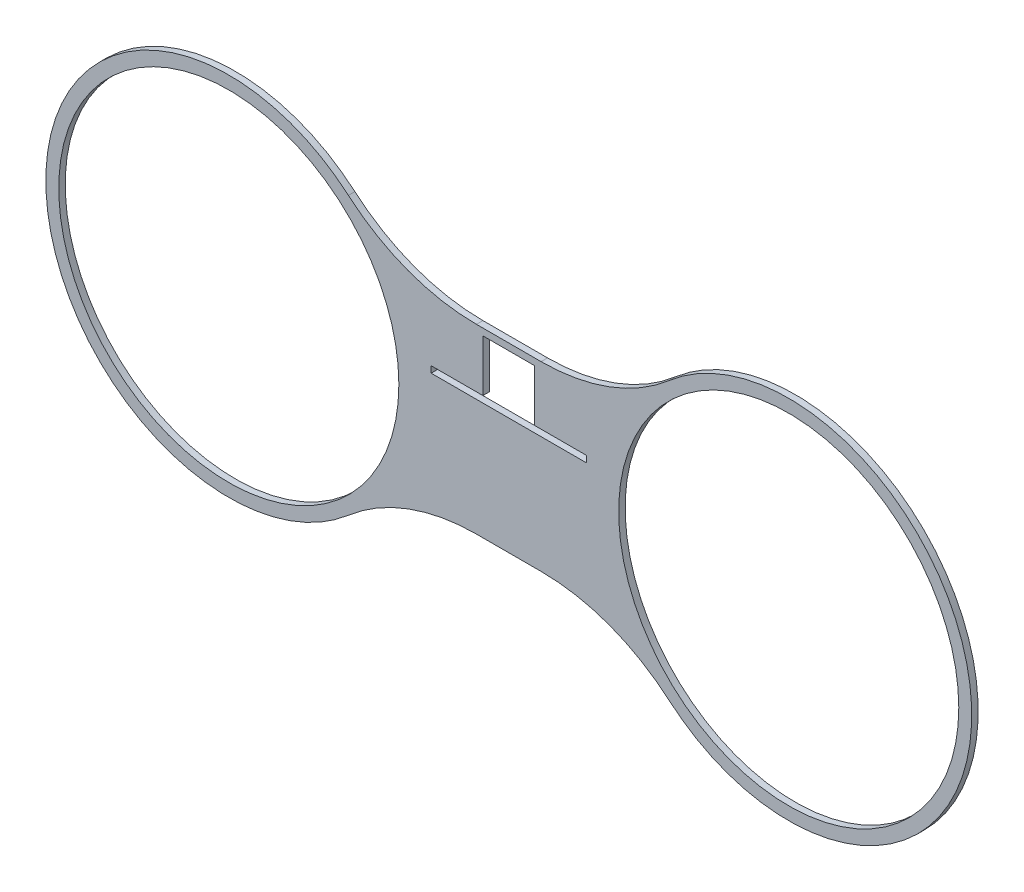
ISO-10303-21;
HEADER;
FILE_DESCRIPTION(('STEP AP214'),'2;1');
FILE_NAME('part.step','',(''),(''),'','','');
FILE_SCHEMA(('AUTOMOTIVE_DESIGN { 1 0 10303 214 1 1 1 1 }'));
ENDSEC;
DATA;
#1=APPLICATION_CONTEXT('core data for automotive mechanical design processes');
#2=APPLICATION_PROTOCOL_DEFINITION('international standard','automotive_design',2000,#1);
#3=PRODUCT_CONTEXT('',#1,'mechanical');
#4=PRODUCT('Part','Part','',(#3));
#5=PRODUCT_RELATED_PRODUCT_CATEGORY('part','',(#4));
#6=PRODUCT_DEFINITION_FORMATION('','',#4);
#7=PRODUCT_DEFINITION_CONTEXT('part definition',#1,'design');
#8=PRODUCT_DEFINITION('design','',#6,#7);
#9=PRODUCT_DEFINITION_SHAPE('','',#8);
#10=(LENGTH_UNIT() NAMED_UNIT(*) SI_UNIT(.MILLI.,.METRE.));
#11=(NAMED_UNIT(*) PLANE_ANGLE_UNIT() SI_UNIT($,.RADIAN.));
#12=(NAMED_UNIT(*) SI_UNIT($,.STERADIAN.) SOLID_ANGLE_UNIT());
#13=UNCERTAINTY_MEASURE_WITH_UNIT(LENGTH_MEASURE(1.E-05),#10,'distance_accuracy_value','');
#14=(GEOMETRIC_REPRESENTATION_CONTEXT(3) GLOBAL_UNCERTAINTY_ASSIGNED_CONTEXT((#13)) GLOBAL_UNIT_ASSIGNED_CONTEXT((#10,
#11,#12)) REPRESENTATION_CONTEXT('',''));
#15=CARTESIAN_POINT('',(0.,0.,0.));
#16=DIRECTION('',(0.,0.,1.));
#17=DIRECTION('',(1.,0.,0.));
#18=AXIS2_PLACEMENT_3D('',#15,#16,#17);
#19=CARTESIAN_POINT('',(15.8526007747364,-140.742861720744,3.175));
#20=DIRECTION('',(0.,0.,1.));
#21=DIRECTION('',(1.,0.,0.));
#22=AXIS2_PLACEMENT_3D('',#19,#20,#21);
#23=PLANE('',#22);
#24=DIRECTION('',(-1.,0.,0.));
#25=VECTOR('',#24,1.);
#26=CARTESIAN_POINT('',(-38.1,15.875000035553,3.175));
#27=LINE('',#26,#25);
#28=CARTESIAN_POINT('',(-12.7,15.875000035553,3.175));
#29=VERTEX_POINT('',#28);
#30=CARTESIAN_POINT('',(-38.1,15.875000035553,3.175));
#31=VERTEX_POINT('',#30);
#32=EDGE_CURVE('E186',#29,#31,#27,.T.);
#33=ORIENTED_EDGE('',*,*,#32,.F.);
#34=DIRECTION('',(0.,-1.,0.));
#35=VECTOR('',#34,1.);
#36=CARTESIAN_POINT('',(-12.7,41.275000035553,3.175));
#37=LINE('',#36,#35);
#38=CARTESIAN_POINT('',(-12.7,41.275000035553,3.175));
#39=VERTEX_POINT('',#38);
#40=EDGE_CURVE('E198',#39,#29,#37,.T.);
#41=ORIENTED_EDGE('',*,*,#40,.F.);
#42=DIRECTION('',(-1.,0.,0.));
#43=VECTOR('',#42,1.);
#44=CARTESIAN_POINT('',(-12.7,41.275000035553,3.175));
#45=LINE('',#44,#43);
#46=CARTESIAN_POINT('',(12.7,41.275000035553,3.175));
#47=VERTEX_POINT('',#46);
#48=EDGE_CURVE('E204',#47,#39,#45,.T.);
#49=ORIENTED_EDGE('',*,*,#48,.F.);
#50=DIRECTION('',(0.,1.,0.));
#51=VECTOR('',#50,1.);
#52=CARTESIAN_POINT('',(12.7,41.275000035553,3.175));
#53=LINE('',#52,#51);
#54=CARTESIAN_POINT('',(12.7,15.875000035553,3.175));
#55=VERTEX_POINT('',#54);
#56=EDGE_CURVE('E48',#55,#47,#53,.T.);
#57=ORIENTED_EDGE('',*,*,#56,.F.);
#58=CARTESIAN_POINT('',(38.1,15.875000035553,3.175));
#59=VERTEX_POINT('',#58);
#60=EDGE_CURVE('E177',#59,#55,#27,.T.);
#61=ORIENTED_EDGE('',*,*,#60,.F.);
#62=DIRECTION('',(0.,1.,0.));
#63=VECTOR('',#62,1.);
#64=CARTESIAN_POINT('',(38.1,12.700000035553,3.175));
#65=LINE('',#64,#63);
#66=CARTESIAN_POINT('',(38.1,12.700000035553,3.175));
#67=VERTEX_POINT('',#66);
#68=EDGE_CURVE('E184',#67,#59,#65,.T.);
#69=ORIENTED_EDGE('',*,*,#68,.F.);
#70=DIRECTION('',(1.,0.,0.));
#71=VECTOR('',#70,1.);
#72=CARTESIAN_POINT('',(-38.1,12.700000035553,3.175));
#73=LINE('',#72,#71);
#74=CARTESIAN_POINT('',(-38.1,12.700000035553,3.175));
#75=VERTEX_POINT('',#74);
#76=EDGE_CURVE('E155',#75,#67,#73,.T.);
#77=ORIENTED_EDGE('',*,*,#76,.F.);
#78=DIRECTION('',(0.,-1.,0.));
#79=VECTOR('',#78,1.);
#80=CARTESIAN_POINT('',(-38.1,12.700000035553,3.175));
#81=LINE('',#80,#79);
#82=EDGE_CURVE('E174',#31,#75,#81,.T.);
#83=ORIENTED_EDGE('',*,*,#82,.F.);
#84=EDGE_LOOP('',(#33,#41,#49,#57,#61,#69,#77,#83));
#85=FACE_BOUND('',#84,.T.);
#86=CARTESIAN_POINT('',(-137.421087546886,-1.13862979215137E-13,3.175));
#87=DIRECTION('',(0.,0.,1.));
#88=DIRECTION('',(1.,0.,0.));
#89=AXIS2_PLACEMENT_3D('',#86,#87,#88);
#90=CIRCLE('',#89,83.4771);
#91=CARTESIAN_POINT('',(-53.9439875468861,-1.13862979215137E-13,3.175));
#92=VERTEX_POINT('',#91);
#93=EDGE_CURVE('E217',#92,#92,#90,.T.);
#94=ORIENTED_EDGE('',*,*,#93,.F.);
#95=EDGE_LOOP('',(#94));
#96=FACE_BOUND('',#95,.T.);
#97=CARTESIAN_POINT('',(15.8526007747364,-140.742861720744,3.175));
#98=DIRECTION('',(0.,0.,-1.));
#99=DIRECTION('',(1.,0.,0.));
#100=AXIS2_PLACEMENT_3D('',#97,#98,#99);
#101=CIRCLE('',#100,96.148519688983);
#102=CARTESIAN_POINT('',(15.8526007747364,-44.5943420317608,3.175));
#103=VERTEX_POINT('',#102);
#104=CARTESIAN_POINT('',(78.7018324643298,-67.9794649170584,3.175));
#105=VERTEX_POINT('',#104);
#106=EDGE_CURVE('E229',#103,#105,#101,.T.);
#107=ORIENTED_EDGE('',*,*,#106,.T.);
#108=CARTESIAN_POINT('',(137.418953,0.,3.175));
#109=DIRECTION('',(0.,0.,1.));
#110=DIRECTION('',(1.,0.,0.));
#111=AXIS2_PLACEMENT_3D('',#108,#109,#110);
#112=CIRCLE('',#111,89.8271);
#113=CARTESIAN_POINT('',(78.7018324643298,67.9794649170585,3.175));
#114=VERTEX_POINT('',#113);
#115=EDGE_CURVE('E232',#105,#114,#112,.T.);
#116=ORIENTED_EDGE('',*,*,#115,.T.);
#117=CARTESIAN_POINT('',(15.8526007747364,140.742861720744,3.175));
#118=DIRECTION('',(0.,0.,-1.));
#119=DIRECTION('',(-1.,0.,0.));
#120=AXIS2_PLACEMENT_3D('',#117,#118,#119);
#121=CIRCLE('',#120,96.148519688983);
#122=CARTESIAN_POINT('',(15.8526007747364,44.5943420317607,3.175));
#123=VERTEX_POINT('',#122);
#124=EDGE_CURVE('E235',#114,#123,#121,.T.);
#125=ORIENTED_EDGE('',*,*,#124,.T.);
#126=DIRECTION('',(-1.,0.,0.));
#127=VECTOR('',#126,1.);
#128=CARTESIAN_POINT('',(15.8526007747364,44.5943420317607,3.175));
#129=LINE('',#128,#127);
#130=CARTESIAN_POINT('',(-15.8547353216224,44.5943420317607,3.175));
#131=VERTEX_POINT('',#130);
#132=EDGE_CURVE('E237',#123,#131,#129,.T.);
#133=ORIENTED_EDGE('',*,*,#132,.T.);
#134=CARTESIAN_POINT('',(-15.8547353216224,140.742861720744,3.175));
#135=DIRECTION('',(0.,0.,-1.));
#136=DIRECTION('',(1.,0.,0.));
#137=AXIS2_PLACEMENT_3D('',#134,#135,#136);
#138=CIRCLE('',#137,96.148519688983);
#139=CARTESIAN_POINT('',(-78.7039670112159,67.9794649170585,3.175));
#140=VERTEX_POINT('',#139);
#141=EDGE_CURVE('E239',#131,#140,#138,.T.);
#142=ORIENTED_EDGE('',*,*,#141,.T.);
#143=CARTESIAN_POINT('',(-137.421087546886,-1.13862979215137E-13,3.175));
#144=DIRECTION('',(0.,0.,1.));
#145=DIRECTION('',(-1.,0.,0.));
#146=AXIS2_PLACEMENT_3D('',#143,#144,#145);
#147=CIRCLE('',#146,89.8271000000001);
#148=CARTESIAN_POINT('',(-78.7039670112158,-67.9794649170586,3.175));
#149=VERTEX_POINT('',#148);
#150=EDGE_CURVE('E241',#140,#149,#147,.T.);
#151=ORIENTED_EDGE('',*,*,#150,.T.);
#152=CARTESIAN_POINT('',(-15.8547353216225,-140.742861720744,3.175));
#153=DIRECTION('',(0.,0.,-1.));
#154=DIRECTION('',(-1.,0.,0.));
#155=AXIS2_PLACEMENT_3D('',#152,#153,#154);
#156=CIRCLE('',#155,96.148519688983);
#157=CARTESIAN_POINT('',(-15.8547353216225,-44.5943420317608,3.175));
#158=VERTEX_POINT('',#157);
#159=EDGE_CURVE('E243',#149,#158,#156,.T.);
#160=ORIENTED_EDGE('',*,*,#159,.T.);
#161=DIRECTION('',(1.,0.,0.));
#162=VECTOR('',#161,1.);
#163=CARTESIAN_POINT('',(-15.8547353216225,-44.5943420317608,3.175));
#164=LINE('',#163,#162);
#165=EDGE_CURVE('E245',#158,#103,#164,.T.);
#166=ORIENTED_EDGE('',*,*,#165,.T.);
#167=EDGE_LOOP('',(#107,#116,#125,#133,#142,#151,#160,#166));
#168=FACE_BOUND('',#167,.T.);
#169=CARTESIAN_POINT('',(137.418953,0.,3.175));
#170=DIRECTION('',(0.,0.,1.));
#171=DIRECTION('',(1.,0.,0.));
#172=AXIS2_PLACEMENT_3D('',#169,#170,#171);
#173=CIRCLE('',#172,83.4771);
#174=CARTESIAN_POINT('',(220.896053,0.,3.175));
#175=VERTEX_POINT('',#174);
#176=EDGE_CURVE('E223',#175,#175,#173,.T.);
#177=ORIENTED_EDGE('',*,*,#176,.F.);
#178=EDGE_LOOP('',(#177));
#179=FACE_BOUND('',#178,.T.);
#180=ADVANCED_FACE('F33',(#85,#96,#168,#179),#23,.T.);
#181=CARTESIAN_POINT('',(15.8526007747364,-140.742861720744,0.));
#182=DIRECTION('',(0.,0.,1.));
#183=DIRECTION('',(1.,0.,0.));
#184=AXIS2_PLACEMENT_3D('',#181,#182,#183);
#185=PLANE('',#184);
#186=DIRECTION('',(0.,-1.,0.));
#187=VECTOR('',#186,1.);
#188=CARTESIAN_POINT('',(-12.7,41.275000035553,0.));
#189=LINE('',#188,#187);
#190=CARTESIAN_POINT('',(-12.7,41.275000035553,0.));
#191=VERTEX_POINT('',#190);
#192=CARTESIAN_POINT('',(-12.7,15.875000035553,0.));
#193=VERTEX_POINT('',#192);
#194=EDGE_CURVE('E56',#191,#193,#189,.T.);
#195=ORIENTED_EDGE('',*,*,#194,.T.);
#196=DIRECTION('',(-1.,0.,0.));
#197=VECTOR('',#196,1.);
#198=CARTESIAN_POINT('',(-38.1,15.875000035553,0.));
#199=LINE('',#198,#197);
#200=CARTESIAN_POINT('',(-38.1,15.875000035553,0.));
#201=VERTEX_POINT('',#200);
#202=EDGE_CURVE('E168',#193,#201,#199,.T.);
#203=ORIENTED_EDGE('',*,*,#202,.T.);
#204=DIRECTION('',(0.,-1.,0.));
#205=VECTOR('',#204,1.);
#206=CARTESIAN_POINT('',(-38.1,12.700000035553,0.));
#207=LINE('',#206,#205);
#208=CARTESIAN_POINT('',(-38.1,12.700000035553,0.));
#209=VERTEX_POINT('',#208);
#210=EDGE_CURVE('E160',#201,#209,#207,.T.);
#211=ORIENTED_EDGE('',*,*,#210,.T.);
#212=DIRECTION('',(1.,0.,0.));
#213=VECTOR('',#212,1.);
#214=CARTESIAN_POINT('',(-38.1,12.700000035553,0.));
#215=LINE('',#214,#213);
#216=CARTESIAN_POINT('',(38.1,12.700000035553,0.));
#217=VERTEX_POINT('',#216);
#218=EDGE_CURVE('E152',#209,#217,#215,.T.);
#219=ORIENTED_EDGE('',*,*,#218,.T.);
#220=DIRECTION('',(0.,1.,0.));
#221=VECTOR('',#220,1.);
#222=CARTESIAN_POINT('',(38.1,12.700000035553,0.));
#223=LINE('',#222,#221);
#224=CARTESIAN_POINT('',(38.1,15.875000035553,0.));
#225=VERTEX_POINT('',#224);
#226=EDGE_CURVE('E163',#217,#225,#223,.T.);
#227=ORIENTED_EDGE('',*,*,#226,.T.);
#228=CARTESIAN_POINT('',(12.7,15.875000035553,0.));
#229=VERTEX_POINT('',#228);
#230=EDGE_CURVE('E180',#225,#229,#199,.T.);
#231=ORIENTED_EDGE('',*,*,#230,.T.);
#232=DIRECTION('',(0.,1.,0.));
#233=VECTOR('',#232,1.);
#234=CARTESIAN_POINT('',(12.7,41.275000035553,0.));
#235=LINE('',#234,#233);
#236=CARTESIAN_POINT('',(12.7,41.275000035553,0.));
#237=VERTEX_POINT('',#236);
#238=EDGE_CURVE('E194',#229,#237,#235,.T.);
#239=ORIENTED_EDGE('',*,*,#238,.T.);
#240=DIRECTION('',(-1.,0.,0.));
#241=VECTOR('',#240,1.);
#242=CARTESIAN_POINT('',(-12.7,41.275000035553,0.));
#243=LINE('',#242,#241);
#244=EDGE_CURVE('E197',#237,#191,#243,.T.);
#245=ORIENTED_EDGE('',*,*,#244,.T.);
#246=EDGE_LOOP('',(#195,#203,#211,#219,#227,#231,#239,#245));
#247=FACE_BOUND('',#246,.T.);
#248=CARTESIAN_POINT('',(15.8526007747364,-140.742861720744,0.));
#249=DIRECTION('',(0.,0.,-1.));
#250=DIRECTION('',(1.,0.,0.));
#251=AXIS2_PLACEMENT_3D('',#248,#249,#250);
#252=CIRCLE('',#251,96.148519688983);
#253=CARTESIAN_POINT('',(15.8526007747364,-44.5943420317608,0.));
#254=VERTEX_POINT('',#253);
#255=CARTESIAN_POINT('',(78.7018324643298,-67.9794649170584,0.));
#256=VERTEX_POINT('',#255);
#257=EDGE_CURVE('E226',#254,#256,#252,.T.);
#258=ORIENTED_EDGE('',*,*,#257,.F.);
#259=DIRECTION('',(1.,0.,0.));
#260=VECTOR('',#259,1.);
#261=CARTESIAN_POINT('',(-15.8547353216225,-44.5943420317608,0.));
#262=LINE('',#261,#260);
#263=CARTESIAN_POINT('',(-15.8547353216225,-44.5943420317608,0.));
#264=VERTEX_POINT('',#263);
#265=EDGE_CURVE('E233',#264,#254,#262,.T.);
#266=ORIENTED_EDGE('',*,*,#265,.F.);
#267=CARTESIAN_POINT('',(-15.8547353216225,-140.742861720744,0.));
#268=DIRECTION('',(0.,0.,-1.));
#269=DIRECTION('',(-1.,0.,0.));
#270=AXIS2_PLACEMENT_3D('',#267,#268,#269);
#271=CIRCLE('',#270,96.148519688983);
#272=CARTESIAN_POINT('',(-78.7039670112158,-67.9794649170586,0.));
#273=VERTEX_POINT('',#272);
#274=EDGE_CURVE('E260',#273,#264,#271,.T.);
#275=ORIENTED_EDGE('',*,*,#274,.F.);
#276=CARTESIAN_POINT('',(-137.421087546886,-1.13862979215137E-13,0.));
#277=DIRECTION('',(0.,0.,1.));
#278=DIRECTION('',(-1.,0.,0.));
#279=AXIS2_PLACEMENT_3D('',#276,#277,#278);
#280=CIRCLE('',#279,89.8271000000001);
#281=CARTESIAN_POINT('',(-78.7039670112159,67.9794649170585,0.));
#282=VERTEX_POINT('',#281);
#283=EDGE_CURVE('E258',#282,#273,#280,.T.);
#284=ORIENTED_EDGE('',*,*,#283,.F.);
#285=CARTESIAN_POINT('',(-15.8547353216224,140.742861720744,0.));
#286=DIRECTION('',(0.,0.,-1.));
#287=DIRECTION('',(1.,0.,0.));
#288=AXIS2_PLACEMENT_3D('',#285,#286,#287);
#289=CIRCLE('',#288,96.148519688983);
#290=CARTESIAN_POINT('',(-15.8547353216224,44.5943420317607,0.));
#291=VERTEX_POINT('',#290);
#292=EDGE_CURVE('E256',#291,#282,#289,.T.);
#293=ORIENTED_EDGE('',*,*,#292,.F.);
#294=DIRECTION('',(-1.,0.,0.));
#295=VECTOR('',#294,1.);
#296=CARTESIAN_POINT('',(15.8526007747364,44.5943420317607,0.));
#297=LINE('',#296,#295);
#298=CARTESIAN_POINT('',(15.8526007747364,44.5943420317607,0.));
#299=VERTEX_POINT('',#298);
#300=EDGE_CURVE('E254',#299,#291,#297,.T.);
#301=ORIENTED_EDGE('',*,*,#300,.F.);
#302=CARTESIAN_POINT('',(15.8526007747364,140.742861720744,0.));
#303=DIRECTION('',(0.,0.,-1.));
#304=DIRECTION('',(-1.,0.,0.));
#305=AXIS2_PLACEMENT_3D('',#302,#303,#304);
#306=CIRCLE('',#305,96.148519688983);
#307=CARTESIAN_POINT('',(78.7018324643298,67.9794649170585,0.));
#308=VERTEX_POINT('',#307);
#309=EDGE_CURVE('E252',#308,#299,#306,.T.);
#310=ORIENTED_EDGE('',*,*,#309,.F.);
#311=CARTESIAN_POINT('',(137.418953,0.,0.));
#312=DIRECTION('',(0.,0.,1.));
#313=DIRECTION('',(1.,0.,0.));
#314=AXIS2_PLACEMENT_3D('',#311,#312,#313);
#315=CIRCLE('',#314,89.8271);
#316=EDGE_CURVE('E250',#256,#308,#315,.T.);
#317=ORIENTED_EDGE('',*,*,#316,.F.);
#318=EDGE_LOOP('',(#258,#266,#275,#284,#293,#301,#310,#317));
#319=FACE_BOUND('',#318,.T.);
#320=CARTESIAN_POINT('',(137.418953,0.,0.));
#321=DIRECTION('',(0.,0.,1.));
#322=DIRECTION('',(1.,0.,0.));
#323=AXIS2_PLACEMENT_3D('',#320,#321,#322);
#324=CIRCLE('',#323,83.4771);
#325=CARTESIAN_POINT('',(220.896053,0.,0.));
#326=VERTEX_POINT('',#325);
#327=EDGE_CURVE('E220',#326,#326,#324,.T.);
#328=ORIENTED_EDGE('',*,*,#327,.T.);
#329=EDGE_LOOP('',(#328));
#330=FACE_BOUND('',#329,.T.);
#331=CARTESIAN_POINT('',(-137.421087546886,-1.13862979215137E-13,0.));
#332=DIRECTION('',(0.,0.,1.));
#333=DIRECTION('',(1.,0.,0.));
#334=AXIS2_PLACEMENT_3D('',#331,#332,#333);
#335=CIRCLE('',#334,83.4771);
#336=CARTESIAN_POINT('',(-53.9439875468861,-1.13862979215137E-13,0.));
#337=VERTEX_POINT('',#336);
#338=EDGE_CURVE('E211',#337,#337,#335,.T.);
#339=ORIENTED_EDGE('',*,*,#338,.T.);
#340=EDGE_LOOP('',(#339));
#341=FACE_BOUND('',#340,.T.);
#342=ADVANCED_FACE('F170',(#247,#319,#330,#341),#185,.F.);
#343=CARTESIAN_POINT('',(15.8526007747364,-140.742861720744,3.175));
#344=DIRECTION('',(0.,0.,-1.));
#345=DIRECTION('',(-1.,0.,0.));
#346=AXIS2_PLACEMENT_3D('',#343,#344,#345);
#347=CYLINDRICAL_SURFACE('',#346,96.148519688983);
#348=ORIENTED_EDGE('',*,*,#257,.T.);
#349=DIRECTION('',(0.,0.,-1.));
#350=VECTOR('',#349,1.);
#351=CARTESIAN_POINT('',(78.7018324643298,-67.9794649170584,3.175));
#352=LINE('',#351,#350);
#353=EDGE_CURVE('E11',#105,#256,#352,.T.);
#354=ORIENTED_EDGE('',*,*,#353,.F.);
#355=ORIENTED_EDGE('',*,*,#106,.F.);
#356=DIRECTION('',(0.,0.,-1.));
#357=VECTOR('',#356,1.);
#358=CARTESIAN_POINT('',(15.8526007747364,-44.5943420317608,3.175));
#359=LINE('',#358,#357);
#360=EDGE_CURVE('E247',#103,#254,#359,.T.);
#361=ORIENTED_EDGE('',*,*,#360,.T.);
#362=EDGE_LOOP('',(#348,#354,#355,#361));
#363=FACE_BOUND('',#362,.T.);
#364=ADVANCED_FACE('F35',(#363),#347,.F.);
#365=CARTESIAN_POINT('',(137.418953,0.,3.175));
#366=DIRECTION('',(0.,0.,-1.));
#367=DIRECTION('',(-1.,0.,0.));
#368=AXIS2_PLACEMENT_3D('',#365,#366,#367);
#369=CYLINDRICAL_SURFACE('',#368,89.8271);
#370=ORIENTED_EDGE('',*,*,#316,.T.);
#371=DIRECTION('',(0.,0.,-1.));
#372=VECTOR('',#371,1.);
#373=CARTESIAN_POINT('',(78.7018324643298,67.9794649170585,3.175));
#374=LINE('',#373,#372);
#375=EDGE_CURVE('E41',#114,#308,#374,.T.);
#376=ORIENTED_EDGE('',*,*,#375,.F.);
#377=ORIENTED_EDGE('',*,*,#115,.F.);
#378=ORIENTED_EDGE('',*,*,#353,.T.);
#379=EDGE_LOOP('',(#370,#376,#377,#378));
#380=FACE_BOUND('',#379,.T.);
#381=ADVANCED_FACE('F306',(#380),#369,.T.);
#382=CARTESIAN_POINT('',(15.8526007747364,140.742861720744,3.175));
#383=DIRECTION('',(0.,0.,-1.));
#384=DIRECTION('',(-1.,0.,0.));
#385=AXIS2_PLACEMENT_3D('',#382,#383,#384);
#386=CYLINDRICAL_SURFACE('',#385,96.148519688983);
#387=ORIENTED_EDGE('',*,*,#309,.T.);
#388=DIRECTION('',(0.,0.,-1.));
#389=VECTOR('',#388,1.);
#390=CARTESIAN_POINT('',(15.8526007747364,44.5943420317607,3.175));
#391=LINE('',#390,#389);
#392=EDGE_CURVE('E277',#123,#299,#391,.T.);
#393=ORIENTED_EDGE('',*,*,#392,.F.);
#394=ORIENTED_EDGE('',*,*,#124,.F.);
#395=ORIENTED_EDGE('',*,*,#375,.T.);
#396=EDGE_LOOP('',(#387,#393,#394,#395));
#397=FACE_BOUND('',#396,.T.);
#398=ADVANCED_FACE('F284',(#397),#386,.F.);
#399=CARTESIAN_POINT('',(15.8526007747364,44.5943420317607,3.175));
#400=DIRECTION('',(0.,-1.,0.));
#401=DIRECTION('',(0.,0.,-1.));
#402=AXIS2_PLACEMENT_3D('',#399,#400,#401);
#403=PLANE('',#402);
#404=ORIENTED_EDGE('',*,*,#300,.T.);
#405=DIRECTION('',(0.,0.,-1.));
#406=VECTOR('',#405,1.);
#407=CARTESIAN_POINT('',(-15.8547353216224,44.5943420317607,3.175));
#408=LINE('',#407,#406);
#409=EDGE_CURVE('E274',#131,#291,#408,.T.);
#410=ORIENTED_EDGE('',*,*,#409,.F.);
#411=ORIENTED_EDGE('',*,*,#132,.F.);
#412=ORIENTED_EDGE('',*,*,#392,.T.);
#413=EDGE_LOOP('',(#404,#410,#411,#412));
#414=FACE_BOUND('',#413,.T.);
#415=ADVANCED_FACE('F294',(#414),#403,.F.);
#416=CARTESIAN_POINT('',(-15.8547353216224,140.742861720744,3.175));
#417=DIRECTION('',(0.,0.,-1.));
#418=DIRECTION('',(-1.,0.,0.));
#419=AXIS2_PLACEMENT_3D('',#416,#417,#418);
#420=CYLINDRICAL_SURFACE('',#419,96.148519688983);
#421=ORIENTED_EDGE('',*,*,#292,.T.);
#422=DIRECTION('',(0.,0.,-1.));
#423=VECTOR('',#422,1.);
#424=CARTESIAN_POINT('',(-78.7039670112159,67.9794649170585,3.175));
#425=LINE('',#424,#423);
#426=EDGE_CURVE('E271',#140,#282,#425,.T.);
#427=ORIENTED_EDGE('',*,*,#426,.F.);
#428=ORIENTED_EDGE('',*,*,#141,.F.);
#429=ORIENTED_EDGE('',*,*,#409,.T.);
#430=EDGE_LOOP('',(#421,#427,#428,#429));
#431=FACE_BOUND('',#430,.T.);
#432=ADVANCED_FACE('F298',(#431),#420,.F.);
#433=CARTESIAN_POINT('',(-137.421087546886,-1.13862979215137E-13,3.175));
#434=DIRECTION('',(0.,0.,-1.));
#435=DIRECTION('',(-1.,0.,0.));
#436=AXIS2_PLACEMENT_3D('',#433,#434,#435);
#437=CYLINDRICAL_SURFACE('',#436,89.8271000000001);
#438=ORIENTED_EDGE('',*,*,#283,.T.);
#439=DIRECTION('',(0.,0.,-1.));
#440=VECTOR('',#439,1.);
#441=CARTESIAN_POINT('',(-78.7039670112158,-67.9794649170586,3.175));
#442=LINE('',#441,#440);
#443=EDGE_CURVE('E268',#149,#273,#442,.T.);
#444=ORIENTED_EDGE('',*,*,#443,.F.);
#445=ORIENTED_EDGE('',*,*,#150,.F.);
#446=ORIENTED_EDGE('',*,*,#426,.T.);
#447=EDGE_LOOP('',(#438,#444,#445,#446));
#448=FACE_BOUND('',#447,.T.);
#449=ADVANCED_FACE('F319',(#448),#437,.T.);
#450=CARTESIAN_POINT('',(-15.8547353216225,-140.742861720744,3.175));
#451=DIRECTION('',(0.,0.,-1.));
#452=DIRECTION('',(-1.,0.,0.));
#453=AXIS2_PLACEMENT_3D('',#450,#451,#452);
#454=CYLINDRICAL_SURFACE('',#453,96.148519688983);
#455=ORIENTED_EDGE('',*,*,#274,.T.);
#456=DIRECTION('',(0.,0.,-1.));
#457=VECTOR('',#456,1.);
#458=CARTESIAN_POINT('',(-15.8547353216225,-44.5943420317608,3.175));
#459=LINE('',#458,#457);
#460=EDGE_CURVE('E265',#158,#264,#459,.T.);
#461=ORIENTED_EDGE('',*,*,#460,.F.);
#462=ORIENTED_EDGE('',*,*,#159,.F.);
#463=ORIENTED_EDGE('',*,*,#443,.T.);
#464=EDGE_LOOP('',(#455,#461,#462,#463));
#465=FACE_BOUND('',#464,.T.);
#466=ADVANCED_FACE('F317',(#465),#454,.F.);
#467=CARTESIAN_POINT('',(-15.8547353216225,-44.5943420317608,3.175));
#468=DIRECTION('',(0.,1.,0.));
#469=DIRECTION('',(0.,0.,1.));
#470=AXIS2_PLACEMENT_3D('',#467,#468,#469);
#471=PLANE('',#470);
#472=ORIENTED_EDGE('',*,*,#265,.T.);
#473=ORIENTED_EDGE('',*,*,#360,.F.);
#474=ORIENTED_EDGE('',*,*,#165,.F.);
#475=ORIENTED_EDGE('',*,*,#460,.T.);
#476=EDGE_LOOP('',(#472,#473,#474,#475));
#477=FACE_BOUND('',#476,.T.);
#478=ADVANCED_FACE('F312',(#477),#471,.F.);
#479=CARTESIAN_POINT('',(137.418953,0.,3.175));
#480=DIRECTION('',(0.,0.,-1.));
#481=DIRECTION('',(-1.,0.,0.));
#482=AXIS2_PLACEMENT_3D('',#479,#480,#481);
#483=CYLINDRICAL_SURFACE('',#482,83.4771);
#484=ORIENTED_EDGE('',*,*,#176,.T.);
#485=EDGE_LOOP('',(#484));
#486=FACE_BOUND('',#485,.T.);
#487=ORIENTED_EDGE('',*,*,#327,.F.);
#488=EDGE_LOOP('',(#487));
#489=FACE_BOUND('',#488,.T.);
#490=ADVANCED_FACE('F339',(#486,#489),#483,.F.);
#491=CARTESIAN_POINT('',(-137.421087546886,-1.13862979215137E-13,3.175));
#492=DIRECTION('',(0.,0.,-1.));
#493=DIRECTION('',(-1.,0.,0.));
#494=AXIS2_PLACEMENT_3D('',#491,#492,#493);
#495=CYLINDRICAL_SURFACE('',#494,83.4771);
#496=ORIENTED_EDGE('',*,*,#93,.T.);
#497=EDGE_LOOP('',(#496));
#498=FACE_BOUND('',#497,.T.);
#499=ORIENTED_EDGE('',*,*,#338,.F.);
#500=EDGE_LOOP('',(#499));
#501=FACE_BOUND('',#500,.T.);
#502=ADVANCED_FACE('F346',(#498,#501),#495,.F.);
#503=CARTESIAN_POINT('',(12.7,41.275000035553,0.));
#504=DIRECTION('',(1.,0.,0.));
#505=DIRECTION('',(0.,1.,0.));
#506=AXIS2_PLACEMENT_3D('',#503,#504,#505);
#507=PLANE('',#506);
#508=ORIENTED_EDGE('',*,*,#56,.T.);
#509=DIRECTION('',(0.,0.,1.));
#510=VECTOR('',#509,1.);
#511=CARTESIAN_POINT('',(12.7,41.275000035553,0.));
#512=LINE('',#511,#510);
#513=EDGE_CURVE('E202',#237,#47,#512,.T.);
#514=ORIENTED_EDGE('',*,*,#513,.F.);
#515=ORIENTED_EDGE('',*,*,#238,.F.);
#516=DIRECTION('',(0.,0.,1.));
#517=VECTOR('',#516,1.);
#518=CARTESIAN_POINT('',(12.7,15.875000035553,0.));
#519=LINE('',#518,#517);
#520=EDGE_CURVE('E209',#229,#55,#519,.T.);
#521=ORIENTED_EDGE('',*,*,#520,.T.);
#522=EDGE_LOOP('',(#508,#514,#515,#521));
#523=FACE_BOUND('',#522,.T.);
#524=ADVANCED_FACE('F351',(#523),#507,.F.);
#525=CARTESIAN_POINT('',(-12.7,41.275000035553,0.));
#526=DIRECTION('',(-1.,0.,0.));
#527=DIRECTION('',(0.,-1.,0.));
#528=AXIS2_PLACEMENT_3D('',#525,#526,#527);
#529=PLANE('',#528);
#530=ORIENTED_EDGE('',*,*,#40,.T.);
#531=DIRECTION('',(0.,0.,1.));
#532=VECTOR('',#531,1.);
#533=CARTESIAN_POINT('',(-12.7,15.875000035553,0.));
#534=LINE('',#533,#532);
#535=EDGE_CURVE('E212',#193,#29,#534,.T.);
#536=ORIENTED_EDGE('',*,*,#535,.F.);
#537=ORIENTED_EDGE('',*,*,#194,.F.);
#538=DIRECTION('',(0.,0.,1.));
#539=VECTOR('',#538,1.);
#540=CARTESIAN_POINT('',(-12.7,41.275000035553,0.));
#541=LINE('',#540,#539);
#542=EDGE_CURVE('E214',#191,#39,#541,.T.);
#543=ORIENTED_EDGE('',*,*,#542,.T.);
#544=EDGE_LOOP('',(#530,#536,#537,#543));
#545=FACE_BOUND('',#544,.T.);
#546=ADVANCED_FACE('F362',(#545),#529,.F.);
#547=CARTESIAN_POINT('',(-12.7,41.275000035553,0.));
#548=DIRECTION('',(0.,1.,0.));
#549=DIRECTION('',(0.,0.,1.));
#550=AXIS2_PLACEMENT_3D('',#547,#548,#549);
#551=PLANE('',#550);
#552=ORIENTED_EDGE('',*,*,#48,.T.);
#553=ORIENTED_EDGE('',*,*,#542,.F.);
#554=ORIENTED_EDGE('',*,*,#244,.F.);
#555=ORIENTED_EDGE('',*,*,#513,.T.);
#556=EDGE_LOOP('',(#552,#553,#554,#555));
#557=FACE_BOUND('',#556,.T.);
#558=ADVANCED_FACE('F365',(#557),#551,.F.);
#559=CARTESIAN_POINT('',(-38.1,15.875000035553,0.));
#560=DIRECTION('',(0.,1.,0.));
#561=DIRECTION('',(0.,0.,1.));
#562=AXIS2_PLACEMENT_3D('',#559,#560,#561);
#563=PLANE('',#562);
#564=ORIENTED_EDGE('',*,*,#230,.F.);
#565=DIRECTION('',(0.,0.,1.));
#566=VECTOR('',#565,1.);
#567=CARTESIAN_POINT('',(38.1,15.875000035553,0.));
#568=LINE('',#567,#566);
#569=EDGE_CURVE('E159',#225,#59,#568,.T.);
#570=ORIENTED_EDGE('',*,*,#569,.T.);
#571=ORIENTED_EDGE('',*,*,#60,.T.);
#572=ORIENTED_EDGE('',*,*,#520,.F.);
#573=EDGE_LOOP('',(#564,#570,#571,#572));
#574=FACE_BOUND('',#573,.T.);
#575=ADVANCED_FACE('F368',(#574),#563,.F.);
#576=ORIENTED_EDGE('',*,*,#32,.T.);
#577=DIRECTION('',(0.,0.,1.));
#578=VECTOR('',#577,1.);
#579=CARTESIAN_POINT('',(-38.1,15.875000035553,0.));
#580=LINE('',#579,#578);
#581=EDGE_CURVE('E190',#201,#31,#580,.T.);
#582=ORIENTED_EDGE('',*,*,#581,.F.);
#583=ORIENTED_EDGE('',*,*,#202,.F.);
#584=ORIENTED_EDGE('',*,*,#535,.T.);
#585=EDGE_LOOP('',(#576,#582,#583,#584));
#586=FACE_BOUND('',#585,.T.);
#587=ADVANCED_FACE('F375',(#586),#563,.F.);
#588=CARTESIAN_POINT('',(-38.1,12.700000035553,0.));
#589=DIRECTION('',(0.,-1.,0.));
#590=DIRECTION('',(1.,0.,0.));
#591=AXIS2_PLACEMENT_3D('',#588,#589,#590);
#592=PLANE('',#591);
#593=ORIENTED_EDGE('',*,*,#76,.T.);
#594=DIRECTION('',(0.,0.,1.));
#595=VECTOR('',#594,1.);
#596=CARTESIAN_POINT('',(38.1,12.700000035553,0.));
#597=LINE('',#596,#595);
#598=EDGE_CURVE('E148',#217,#67,#597,.T.);
#599=ORIENTED_EDGE('',*,*,#598,.F.);
#600=ORIENTED_EDGE('',*,*,#218,.F.);
#601=DIRECTION('',(0.,0.,1.));
#602=VECTOR('',#601,1.);
#603=CARTESIAN_POINT('',(-38.1,12.700000035553,0.));
#604=LINE('',#603,#602);
#605=EDGE_CURVE('E188',#209,#75,#604,.T.);
#606=ORIENTED_EDGE('',*,*,#605,.T.);
#607=EDGE_LOOP('',(#593,#599,#600,#606));
#608=FACE_BOUND('',#607,.T.);
#609=ADVANCED_FACE('F150',(#608),#592,.F.);
#610=CARTESIAN_POINT('',(-38.1,12.700000035553,0.));
#611=DIRECTION('',(-1.,0.,0.));
#612=DIRECTION('',(0.,0.,1.));
#613=AXIS2_PLACEMENT_3D('',#610,#611,#612);
#614=PLANE('',#613);
#615=ORIENTED_EDGE('',*,*,#82,.T.);
#616=ORIENTED_EDGE('',*,*,#605,.F.);
#617=ORIENTED_EDGE('',*,*,#210,.F.);
#618=ORIENTED_EDGE('',*,*,#581,.T.);
#619=EDGE_LOOP('',(#615,#616,#617,#618));
#620=FACE_BOUND('',#619,.T.);
#621=ADVANCED_FACE('F374',(#620),#614,.F.);
#622=CARTESIAN_POINT('',(38.1,12.700000035553,0.));
#623=DIRECTION('',(1.,0.,0.));
#624=DIRECTION('',(0.,0.,-1.));
#625=AXIS2_PLACEMENT_3D('',#622,#623,#624);
#626=PLANE('',#625);
#627=ORIENTED_EDGE('',*,*,#68,.T.);
#628=ORIENTED_EDGE('',*,*,#569,.F.);
#629=ORIENTED_EDGE('',*,*,#226,.F.);
#630=ORIENTED_EDGE('',*,*,#598,.T.);
#631=EDGE_LOOP('',(#627,#628,#629,#630));
#632=FACE_BOUND('',#631,.T.);
#633=ADVANCED_FACE('F164',(#632),#626,.F.);
#634=CLOSED_SHELL('',(#180,#342,#364,#381,#398,#415,#432,#449,#466,#478,#490,#502,#524,#546,
#558,#575,#587,#609,#621,#633));
#635=MANIFOLD_SOLID_BREP('B2',#634);
#636=ADVANCED_BREP_SHAPE_REPRESENTATION('',(#18,#635),#14);
#637=SHAPE_DEFINITION_REPRESENTATION(#9,#636);
ENDSEC;
END-ISO-10303-21;
